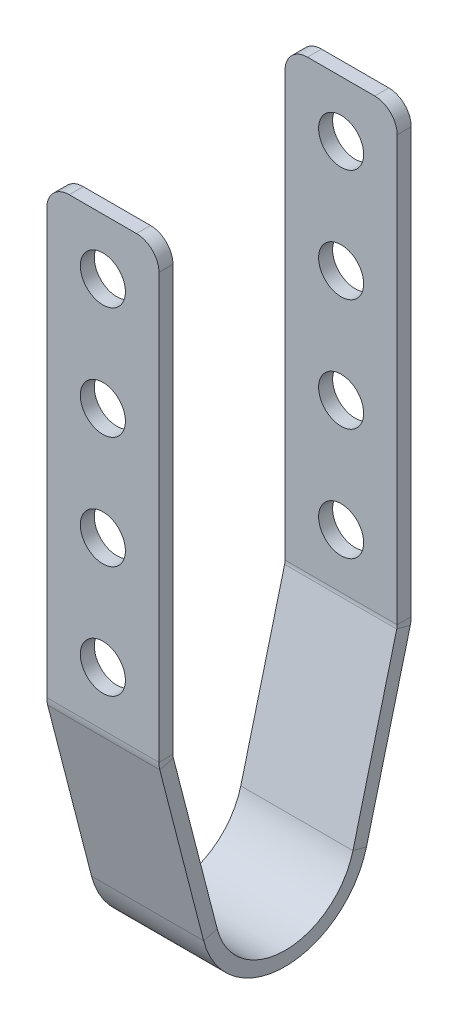
ISO-10303-21;
HEADER;
FILE_DESCRIPTION(('STEP AP214'),'2;1');
FILE_NAME('part.step','',(''),(''),'','','');
FILE_SCHEMA(('AUTOMOTIVE_DESIGN { 1 0 10303 214 1 1 1 1 }'));
ENDSEC;
DATA;
#1=APPLICATION_CONTEXT('core data for automotive mechanical design processes');
#2=APPLICATION_PROTOCOL_DEFINITION('international standard','automotive_design',2000,#1);
#3=PRODUCT_CONTEXT('',#1,'mechanical');
#4=PRODUCT('Part','Part','',(#3));
#5=PRODUCT_RELATED_PRODUCT_CATEGORY('part','',(#4));
#6=PRODUCT_DEFINITION_FORMATION('','',#4);
#7=PRODUCT_DEFINITION_CONTEXT('part definition',#1,'design');
#8=PRODUCT_DEFINITION('design','',#6,#7);
#9=PRODUCT_DEFINITION_SHAPE('','',#8);
#10=(LENGTH_UNIT() NAMED_UNIT(*) SI_UNIT(.MILLI.,.METRE.));
#11=(NAMED_UNIT(*) PLANE_ANGLE_UNIT() SI_UNIT($,.RADIAN.));
#12=(NAMED_UNIT(*) SI_UNIT($,.STERADIAN.) SOLID_ANGLE_UNIT());
#13=UNCERTAINTY_MEASURE_WITH_UNIT(LENGTH_MEASURE(1.E-05),#10,'distance_accuracy_value','');
#14=(GEOMETRIC_REPRESENTATION_CONTEXT(3) GLOBAL_UNCERTAINTY_ASSIGNED_CONTEXT((#13)) GLOBAL_UNIT_ASSIGNED_CONTEXT((#10,
#11,#12)) REPRESENTATION_CONTEXT('',''));
#15=CARTESIAN_POINT('',(0.,0.,0.));
#16=DIRECTION('',(0.,0.,1.));
#17=DIRECTION('',(1.,0.,0.));
#18=AXIS2_PLACEMENT_3D('',#15,#16,#17);
#19=CARTESIAN_POINT('',(6.35,-70.2444244631501,-20.3860836368314));
#20=DIRECTION('',(1.,0.,0.));
#21=DIRECTION('',(0.,0.,-1.));
#22=AXIS2_PLACEMENT_3D('',#19,#20,#21);
#23=PLANE('',#22);
#24=DIRECTION('',(0.,-0.249691270948047,-0.96832549755356));
#25=VECTOR('',#24,1.);
#26=CARTESIAN_POINT('',(6.35,-70.2444244631501,-20.3860836368314));
#27=LINE('',#26,#25);
#28=CARTESIAN_POINT('',(6.35,-70.2444244631501,-20.3860836368314));
#29=VERTEX_POINT('',#28);
#30=CARTESIAN_POINT('',(6.35,-70.6408093557801,-21.9233003641977));
#31=VERTEX_POINT('',#30);
#32=EDGE_CURVE('E352',#29,#31,#27,.T.);
#33=ORIENTED_EDGE('',*,*,#32,.F.);
#34=CARTESIAN_POINT('',(6.35,-68.2625,-12.7));
#35=DIRECTION('',(1.,0.,0.));
#36=DIRECTION('',(0.,0.,-1.));
#37=AXIS2_PLACEMENT_3D('',#34,#35,#36);
#38=CIRCLE('',#37,7.9375);
#39=CARTESIAN_POINT('',(6.35,-70.2444244631501,-5.01391636316861));
#40=VERTEX_POINT('',#39);
#41=EDGE_CURVE('E225',#40,#29,#38,.T.);
#42=ORIENTED_EDGE('',*,*,#41,.F.);
#43=DIRECTION('',(0.,0.249691270948038,-0.968325497553562));
#44=VECTOR('',#43,1.);
#45=CARTESIAN_POINT('',(6.35,-70.6408093557801,-3.47669963580233));
#46=LINE('',#45,#44);
#47=CARTESIAN_POINT('',(6.35,-70.6408093557801,-3.47669963580233));
#48=VERTEX_POINT('',#47);
#49=EDGE_CURVE('E350',#48,#40,#46,.T.);
#50=ORIENTED_EDGE('',*,*,#49,.F.);
#51=CARTESIAN_POINT('',(6.35,-68.2625,-12.7));
#52=DIRECTION('',(1.,0.,0.));
#53=DIRECTION('',(0.,0.,-1.));
#54=AXIS2_PLACEMENT_3D('',#51,#52,#53);
#55=CIRCLE('',#54,9.525);
#56=EDGE_CURVE('E247',#48,#31,#55,.T.);
#57=ORIENTED_EDGE('',*,*,#56,.T.);
#58=EDGE_LOOP('',(#33,#42,#50,#57));
#59=FACE_BOUND('',#58,.T.);
#60=ADVANCED_FACE('F46',(#59),#23,.T.);
#61=CARTESIAN_POINT('',(6.35,-70.6408093557801,-3.47669963580233));
#62=DIRECTION('',(1.,0.,0.));
#63=DIRECTION('',(0.,0.,-1.));
#64=AXIS2_PLACEMENT_3D('',#61,#62,#63);
#65=PLANE('',#64);
#66=DIRECTION('',(0.,0.96832549755356,-0.249691270948044));
#67=VECTOR('',#66,1.);
#68=CARTESIAN_POINT('',(6.35,-70.2444244631501,-20.3860836368314));
#69=LINE('',#68,#67);
#70=CARTESIAN_POINT('',(6.35,-50.9950031124709,-25.3497167273663));
#71=VERTEX_POINT('',#70);
#72=EDGE_CURVE('E223',#29,#71,#69,.T.);
#73=ORIENTED_EDGE('',*,*,#72,.F.);
#74=ORIENTED_EDGE('',*,*,#32,.T.);
#75=DIRECTION('',(0.,0.96832549755356,-0.249691270948044));
#76=VECTOR('',#75,1.);
#77=CARTESIAN_POINT('',(6.35,-70.6408093557801,-21.9233003641977));
#78=LINE('',#77,#76);
#79=CARTESIAN_POINT('',(6.35,-51.391388005101,-26.8869334547325));
#80=VERTEX_POINT('',#79);
#81=EDGE_CURVE('E250',#31,#80,#78,.T.);
#82=ORIENTED_EDGE('',*,*,#81,.T.);
#83=DIRECTION('',(0.,0.249691270948054,0.968325497553558));
#84=VECTOR('',#83,1.);
#85=CARTESIAN_POINT('',(6.35,-51.391388005101,-26.8869334547325));
#86=LINE('',#85,#84);
#87=EDGE_CURVE('E197',#80,#71,#86,.T.);
#88=ORIENTED_EDGE('',*,*,#87,.T.);
#89=EDGE_LOOP('',(#73,#74,#82,#88));
#90=FACE_BOUND('',#89,.T.);
#91=ADVANCED_FACE('F441',(#90),#65,.T.);
#92=CARTESIAN_POINT('',(-6.35,-70.2444244631501,-5.01391636316861));
#93=DIRECTION('',(-1.,0.,0.));
#94=DIRECTION('',(0.,0.,1.));
#95=AXIS2_PLACEMENT_3D('',#92,#93,#94);
#96=PLANE('',#95);
#97=DIRECTION('',(0.,-0.249691270948038,0.968325497553562));
#98=VECTOR('',#97,1.);
#99=CARTESIAN_POINT('',(-6.35,-70.2444244631501,-5.01391636316861));
#100=LINE('',#99,#98);
#101=CARTESIAN_POINT('',(-6.35,-70.2444244631501,-5.01391636316861));
#102=VERTEX_POINT('',#101);
#103=CARTESIAN_POINT('',(-6.35,-70.6408093557801,-3.47669963580233));
#104=VERTEX_POINT('',#103);
#105=EDGE_CURVE('E348',#102,#104,#100,.T.);
#106=ORIENTED_EDGE('',*,*,#105,.F.);
#107=CARTESIAN_POINT('',(-6.35,-68.2625,-12.7));
#108=DIRECTION('',(1.,0.,0.));
#109=DIRECTION('',(0.,0.,-1.));
#110=AXIS2_PLACEMENT_3D('',#107,#108,#109);
#111=CIRCLE('',#110,7.9375);
#112=CARTESIAN_POINT('',(-6.35,-70.2444244631501,-20.3860836368314));
#113=VERTEX_POINT('',#112);
#114=EDGE_CURVE('E265',#102,#113,#111,.T.);
#115=ORIENTED_EDGE('',*,*,#114,.T.);
#116=DIRECTION('',(0.,0.249691270948047,0.96832549755356));
#117=VECTOR('',#116,1.);
#118=CARTESIAN_POINT('',(-6.35,-70.6408093557801,-21.9233003641977));
#119=LINE('',#118,#117);
#120=CARTESIAN_POINT('',(-6.35,-70.6408093557801,-21.9233003641977));
#121=VERTEX_POINT('',#120);
#122=EDGE_CURVE('E346',#121,#113,#119,.T.);
#123=ORIENTED_EDGE('',*,*,#122,.F.);
#124=CARTESIAN_POINT('',(-6.35,-68.2625,-12.7));
#125=DIRECTION('',(1.,0.,0.));
#126=DIRECTION('',(0.,0.,-1.));
#127=AXIS2_PLACEMENT_3D('',#124,#125,#126);
#128=CIRCLE('',#127,9.525);
#129=EDGE_CURVE('E284',#104,#121,#128,.T.);
#130=ORIENTED_EDGE('',*,*,#129,.F.);
#131=EDGE_LOOP('',(#106,#115,#123,#130));
#132=FACE_BOUND('',#131,.T.);
#133=ADVANCED_FACE('F533',(#132),#96,.T.);
#134=CARTESIAN_POINT('',(-6.35,-70.6408093557801,-21.9233003641977));
#135=DIRECTION('',(-1.,0.,0.));
#136=DIRECTION('',(0.,0.,1.));
#137=AXIS2_PLACEMENT_3D('',#134,#135,#136);
#138=PLANE('',#137);
#139=DIRECTION('',(0.,-0.968325497553561,-0.249691270948044));
#140=VECTOR('',#139,1.);
#141=CARTESIAN_POINT('',(-6.35,-50.8,0.));
#142=LINE('',#141,#140);
#143=CARTESIAN_POINT('',(-6.35,-50.9950031124709,-0.0502832726337363));
#144=VERTEX_POINT('',#143);
#145=EDGE_CURVE('E268',#144,#102,#142,.T.);
#146=ORIENTED_EDGE('',*,*,#145,.T.);
#147=ORIENTED_EDGE('',*,*,#105,.T.);
#148=DIRECTION('',(0.,-0.968325497553561,-0.249691270948044));
#149=VECTOR('',#148,1.);
#150=CARTESIAN_POINT('',(-6.35,-51.19638489263,1.53721672736627));
#151=LINE('',#150,#149);
#152=CARTESIAN_POINT('',(-6.35,-51.3913880051009,1.48693345473254));
#153=VERTEX_POINT('',#152);
#154=EDGE_CURVE('E281',#153,#104,#151,.T.);
#155=ORIENTED_EDGE('',*,*,#154,.F.);
#156=DIRECTION('',(0.,0.249691270948043,-0.968325497553561));
#157=VECTOR('',#156,1.);
#158=CARTESIAN_POINT('',(-6.35,-51.3913880051009,1.48693345473254));
#159=LINE('',#158,#157);
#160=EDGE_CURVE('E196',#153,#144,#159,.T.);
#161=ORIENTED_EDGE('',*,*,#160,.T.);
#162=EDGE_LOOP('',(#146,#147,#155,#161));
#163=FACE_BOUND('',#162,.T.);
#164=ADVANCED_FACE('F884',(#163),#138,.T.);
#165=CARTESIAN_POINT('',(6.35,-50.9950031124709,-0.0502832726337363));
#166=DIRECTION('',(1.,0.,0.));
#167=DIRECTION('',(0.,0.,-1.));
#168=AXIS2_PLACEMENT_3D('',#165,#166,#167);
#169=PLANE('',#168);
#170=DIRECTION('',(0.,-0.249691270948043,0.968325497553561));
#171=VECTOR('',#170,1.);
#172=CARTESIAN_POINT('',(6.35,-50.9950031124709,-0.0502832726337363));
#173=LINE('',#172,#171);
#174=CARTESIAN_POINT('',(6.35,-50.9950031124709,-0.0502832726337363));
#175=VERTEX_POINT('',#174);
#176=CARTESIAN_POINT('',(6.35,-51.3913880051009,1.48693345473254));
#177=VERTEX_POINT('',#176);
#178=EDGE_CURVE('E344',#175,#177,#173,.T.);
#179=ORIENTED_EDGE('',*,*,#178,.F.);
#180=CARTESIAN_POINT('',(6.35,-50.5986182198409,-1.58750000000001));
#181=DIRECTION('',(-1.,0.,0.));
#182=DIRECTION('',(0.,0.,1.));
#183=AXIS2_PLACEMENT_3D('',#180,#181,#182);
#184=CIRCLE('',#183,1.5875);
#185=CARTESIAN_POINT('',(6.35,-50.5986182198409,0.));
#186=VERTEX_POINT('',#185);
#187=EDGE_CURVE('E234',#186,#175,#184,.F.);
#188=ORIENTED_EDGE('',*,*,#187,.F.);
#189=DIRECTION('',(0.,0.,-1.));
#190=VECTOR('',#189,1.);
#191=CARTESIAN_POINT('',(6.35,-50.5986182198409,1.58749999999999));
#192=LINE('',#191,#190);
#193=CARTESIAN_POINT('',(6.35,-50.5986182198409,1.58749999999999));
#194=VERTEX_POINT('',#193);
#195=EDGE_CURVE('E341',#194,#186,#192,.T.);
#196=ORIENTED_EDGE('',*,*,#195,.F.);
#197=CARTESIAN_POINT('',(6.35,-50.5986182198409,-1.58750000000001));
#198=DIRECTION('',(1.,0.,0.));
#199=DIRECTION('',(0.,0.,-1.));
#200=AXIS2_PLACEMENT_3D('',#197,#198,#199);
#201=CIRCLE('',#200,3.175);
#202=EDGE_CURVE('E241',#194,#177,#201,.T.);
#203=ORIENTED_EDGE('',*,*,#202,.T.);
#204=EDGE_LOOP('',(#179,#188,#196,#203));
#205=FACE_BOUND('',#204,.T.);
#206=ADVANCED_FACE('F415',(#205),#169,.T.);
#207=CARTESIAN_POINT('',(6.35,-50.5986182198409,1.58749999999999));
#208=DIRECTION('',(1.,0.,0.));
#209=DIRECTION('',(0.,0.,-1.));
#210=AXIS2_PLACEMENT_3D('',#207,#208,#209);
#211=PLANE('',#210);
#212=DIRECTION('',(0.,-0.968325497553561,-0.249691270948044));
#213=VECTOR('',#212,1.);
#214=CARTESIAN_POINT('',(6.35,-50.8,0.));
#215=LINE('',#214,#213);
#216=EDGE_CURVE('E231',#175,#40,#215,.T.);
#217=ORIENTED_EDGE('',*,*,#216,.F.);
#218=ORIENTED_EDGE('',*,*,#178,.T.);
#219=DIRECTION('',(0.,-0.968325497553561,-0.249691270948044));
#220=VECTOR('',#219,1.);
#221=CARTESIAN_POINT('',(6.35,-51.19638489263,1.53721672736627));
#222=LINE('',#221,#220);
#223=EDGE_CURVE('E244',#177,#48,#222,.T.);
#224=ORIENTED_EDGE('',*,*,#223,.T.);
#225=ORIENTED_EDGE('',*,*,#49,.T.);
#226=EDGE_LOOP('',(#217,#218,#224,#225));
#227=FACE_BOUND('',#226,.T.);
#228=ADVANCED_FACE('F424',(#227),#211,.T.);
#229=CARTESIAN_POINT('',(-6.35,-50.5986182198409,0.));
#230=DIRECTION('',(-1.,0.,0.));
#231=DIRECTION('',(0.,0.,1.));
#232=AXIS2_PLACEMENT_3D('',#229,#230,#231);
#233=PLANE('',#232);
#234=DIRECTION('',(0.,0.,1.));
#235=VECTOR('',#234,1.);
#236=CARTESIAN_POINT('',(-6.35,-50.5986182198409,0.));
#237=LINE('',#236,#235);
#238=CARTESIAN_POINT('',(-6.35,-50.5986182198409,0.));
#239=VERTEX_POINT('',#238);
#240=CARTESIAN_POINT('',(-6.35,-50.5986182198409,1.58749999999999));
#241=VERTEX_POINT('',#240);
#242=EDGE_CURVE('E338',#239,#241,#237,.T.);
#243=ORIENTED_EDGE('',*,*,#242,.F.);
#244=CARTESIAN_POINT('',(-6.35,-50.5986182198409,-1.58750000000001));
#245=DIRECTION('',(-1.,0.,0.));
#246=DIRECTION('',(0.,0.,1.));
#247=AXIS2_PLACEMENT_3D('',#244,#245,#246);
#248=CIRCLE('',#247,1.5875);
#249=EDGE_CURVE('E271',#239,#144,#248,.F.);
#250=ORIENTED_EDGE('',*,*,#249,.T.);
#251=ORIENTED_EDGE('',*,*,#160,.F.);
#252=CARTESIAN_POINT('',(-6.35,-50.5986182198409,-1.58750000000001));
#253=DIRECTION('',(1.,0.,0.));
#254=DIRECTION('',(0.,0.,-1.));
#255=AXIS2_PLACEMENT_3D('',#252,#253,#254);
#256=CIRCLE('',#255,3.175);
#257=EDGE_CURVE('E278',#241,#153,#256,.T.);
#258=ORIENTED_EDGE('',*,*,#257,.F.);
#259=EDGE_LOOP('',(#243,#250,#251,#258));
#260=FACE_BOUND('',#259,.T.);
#261=ADVANCED_FACE('F650',(#260),#233,.T.);
#262=CARTESIAN_POINT('',(-6.35,-51.3913880051009,1.48693345473254));
#263=DIRECTION('',(-1.,0.,0.));
#264=DIRECTION('',(0.,0.,1.));
#265=AXIS2_PLACEMENT_3D('',#262,#263,#264);
#266=PLANE('',#265);
#267=DIRECTION('',(0.,-1.,0.));
#268=VECTOR('',#267,1.);
#269=CARTESIAN_POINT('',(-6.35,0.,1.5875));
#270=LINE('',#269,#268);
#271=CARTESIAN_POINT('',(-6.35,-2.54,1.5875));
#272=VERTEX_POINT('',#271);
#273=EDGE_CURVE('E276',#272,#241,#270,.T.);
#274=ORIENTED_EDGE('',*,*,#273,.F.);
#275=DIRECTION('',(0.,0.,-1.));
#276=VECTOR('',#275,1.);
#277=CARTESIAN_POINT('',(-6.35,-2.54,1.48693345473255));
#278=LINE('',#277,#276);
#279=CARTESIAN_POINT('',(-6.35,-2.54,0.));
#280=VERTEX_POINT('',#279);
#281=EDGE_CURVE('E376',#272,#280,#278,.T.);
#282=ORIENTED_EDGE('',*,*,#281,.T.);
#283=DIRECTION('',(0.,-1.,0.));
#284=VECTOR('',#283,1.);
#285=CARTESIAN_POINT('',(-6.35,0.,0.));
#286=LINE('',#285,#284);
#287=EDGE_CURVE('E274',#280,#239,#286,.T.);
#288=ORIENTED_EDGE('',*,*,#287,.T.);
#289=ORIENTED_EDGE('',*,*,#242,.T.);
#290=EDGE_LOOP('',(#274,#282,#288,#289));
#291=FACE_BOUND('',#290,.T.);
#292=ADVANCED_FACE('F396',(#291),#266,.T.);
#293=CARTESIAN_POINT('',(6.35,-50.5986182198409,-25.4));
#294=DIRECTION('',(1.,0.,0.));
#295=DIRECTION('',(0.,0.,-1.));
#296=AXIS2_PLACEMENT_3D('',#293,#294,#295);
#297=PLANE('',#296);
#298=DIRECTION('',(0.,0.,-1.));
#299=VECTOR('',#298,1.);
#300=CARTESIAN_POINT('',(6.35,-50.5986182198409,-25.4));
#301=LINE('',#300,#299);
#302=CARTESIAN_POINT('',(6.35,-50.5986182198409,-25.4));
#303=VERTEX_POINT('',#302);
#304=CARTESIAN_POINT('',(6.35,-50.5986182198409,-26.9875));
#305=VERTEX_POINT('',#304);
#306=EDGE_CURVE('E184',#303,#305,#301,.T.);
#307=ORIENTED_EDGE('',*,*,#306,.F.);
#308=CARTESIAN_POINT('',(6.35,-50.5986182198409,-23.8125));
#309=DIRECTION('',(-1.,0.,0.));
#310=DIRECTION('',(0.,0.,1.));
#311=AXIS2_PLACEMENT_3D('',#308,#309,#310);
#312=CIRCLE('',#311,1.5875);
#313=EDGE_CURVE('E188',#71,#303,#312,.F.);
#314=ORIENTED_EDGE('',*,*,#313,.F.);
#315=ORIENTED_EDGE('',*,*,#87,.F.);
#316=CARTESIAN_POINT('',(6.35,-50.5986182198409,-23.8125));
#317=DIRECTION('',(1.,0.,0.));
#318=DIRECTION('',(0.,0.,-1.));
#319=AXIS2_PLACEMENT_3D('',#316,#317,#318);
#320=CIRCLE('',#319,3.175);
#321=EDGE_CURVE('E191',#80,#305,#320,.T.);
#322=ORIENTED_EDGE('',*,*,#321,.T.);
#323=EDGE_LOOP('',(#307,#314,#315,#322));
#324=FACE_BOUND('',#323,.T.);
#325=ADVANCED_FACE('F186',(#324),#297,.T.);
#326=CARTESIAN_POINT('',(6.35,-51.391388005101,-26.8869334547325));
#327=DIRECTION('',(1.,0.,0.));
#328=DIRECTION('',(0.,0.,-1.));
#329=AXIS2_PLACEMENT_3D('',#326,#327,#328);
#330=PLANE('',#329);
#331=DIRECTION('',(0.,1.,0.));
#332=VECTOR('',#331,1.);
#333=CARTESIAN_POINT('',(6.35,-50.8,-26.9875));
#334=LINE('',#333,#332);
#335=CARTESIAN_POINT('',(6.35,-2.54,-26.9875));
#336=VERTEX_POINT('',#335);
#337=EDGE_CURVE('E218',#305,#336,#334,.T.);
#338=ORIENTED_EDGE('',*,*,#337,.T.);
#339=DIRECTION('',(0.,0.,-1.));
#340=VECTOR('',#339,1.);
#341=CARTESIAN_POINT('',(6.35,-2.54,-26.8869334547325));
#342=LINE('',#341,#340);
#343=CARTESIAN_POINT('',(6.35,-2.54,-25.4));
#344=VERTEX_POINT('',#343);
#345=EDGE_CURVE('E217',#336,#344,#342,.F.);
#346=ORIENTED_EDGE('',*,*,#345,.T.);
#347=DIRECTION('',(0.,1.,0.));
#348=VECTOR('',#347,1.);
#349=CARTESIAN_POINT('',(6.35,-50.8,-25.4));
#350=LINE('',#349,#348);
#351=EDGE_CURVE('E205',#303,#344,#350,.T.);
#352=ORIENTED_EDGE('',*,*,#351,.F.);
#353=ORIENTED_EDGE('',*,*,#306,.T.);
#354=EDGE_LOOP('',(#338,#346,#352,#353));
#355=FACE_BOUND('',#354,.T.);
#356=ADVANCED_FACE('F215',(#355),#330,.T.);
#357=CARTESIAN_POINT('',(-6.35,-50.9950031124709,-25.3497167273663));
#358=DIRECTION('',(-1.,0.,0.));
#359=DIRECTION('',(0.,0.,1.));
#360=AXIS2_PLACEMENT_3D('',#357,#358,#359);
#361=PLANE('',#360);
#362=DIRECTION('',(0.,-0.249691270948054,-0.968325497553558));
#363=VECTOR('',#362,1.);
#364=CARTESIAN_POINT('',(-6.35,-50.9950031124709,-25.3497167273663));
#365=LINE('',#364,#363);
#366=CARTESIAN_POINT('',(-6.35,-50.9950031124709,-25.3497167273663));
#367=VERTEX_POINT('',#366);
#368=CARTESIAN_POINT('',(-6.35,-51.391388005101,-26.8869334547325));
#369=VERTEX_POINT('',#368);
#370=EDGE_CURVE('E334',#367,#369,#365,.T.);
#371=ORIENTED_EDGE('',*,*,#370,.F.);
#372=CARTESIAN_POINT('',(-6.35,-50.5986182198409,-23.8125));
#373=DIRECTION('',(-1.,0.,0.));
#374=DIRECTION('',(0.,0.,1.));
#375=AXIS2_PLACEMENT_3D('',#372,#373,#374);
#376=CIRCLE('',#375,1.5875);
#377=CARTESIAN_POINT('',(-6.35,-50.5986182198409,-25.4));
#378=VERTEX_POINT('',#377);
#379=EDGE_CURVE('E260',#367,#378,#376,.F.);
#380=ORIENTED_EDGE('',*,*,#379,.T.);
#381=DIRECTION('',(0.,0.,1.));
#382=VECTOR('',#381,1.);
#383=CARTESIAN_POINT('',(-6.35,-50.5986182198409,-26.9875));
#384=LINE('',#383,#382);
#385=CARTESIAN_POINT('',(-6.35,-50.5986182198409,-26.9875));
#386=VERTEX_POINT('',#385);
#387=EDGE_CURVE('E332',#386,#378,#384,.T.);
#388=ORIENTED_EDGE('',*,*,#387,.F.);
#389=CARTESIAN_POINT('',(-6.35,-50.5986182198409,-23.8125));
#390=DIRECTION('',(1.,0.,0.));
#391=DIRECTION('',(0.,0.,-1.));
#392=AXIS2_PLACEMENT_3D('',#389,#390,#391);
#393=CIRCLE('',#392,3.175);
#394=EDGE_CURVE('E290',#369,#386,#393,.T.);
#395=ORIENTED_EDGE('',*,*,#394,.F.);
#396=EDGE_LOOP('',(#371,#380,#388,#395));
#397=FACE_BOUND('',#396,.T.);
#398=ADVANCED_FACE('F640',(#397),#361,.T.);
#399=CARTESIAN_POINT('',(-6.35,-50.5986182198409,-26.9875));
#400=DIRECTION('',(-1.,0.,0.));
#401=DIRECTION('',(0.,0.,1.));
#402=AXIS2_PLACEMENT_3D('',#399,#400,#401);
#403=PLANE('',#402);
#404=DIRECTION('',(0.,0.96832549755356,-0.249691270948044));
#405=VECTOR('',#404,1.);
#406=CARTESIAN_POINT('',(-6.35,-70.2444244631501,-20.3860836368314));
#407=LINE('',#406,#405);
#408=EDGE_CURVE('E262',#113,#367,#407,.T.);
#409=ORIENTED_EDGE('',*,*,#408,.T.);
#410=ORIENTED_EDGE('',*,*,#370,.T.);
#411=DIRECTION('',(0.,0.96832549755356,-0.249691270948044));
#412=VECTOR('',#411,1.);
#413=CARTESIAN_POINT('',(-6.35,-70.6408093557801,-21.9233003641977));
#414=LINE('',#413,#412);
#415=EDGE_CURVE('E287',#121,#369,#414,.T.);
#416=ORIENTED_EDGE('',*,*,#415,.F.);
#417=ORIENTED_EDGE('',*,*,#122,.T.);
#418=EDGE_LOOP('',(#409,#410,#416,#417));
#419=FACE_BOUND('',#418,.T.);
#420=ADVANCED_FACE('F630',(#419),#403,.T.);
#421=CARTESIAN_POINT('',(6.35,-50.8,-26.9875));
#422=DIRECTION('',(0.,0.,1.));
#423=DIRECTION('',(1.,0.,0.));
#424=AXIS2_PLACEMENT_3D('',#421,#422,#423);
#425=PLANE('',#424);
#426=CARTESIAN_POINT('',(0.,-6.35,-26.9875));
#427=DIRECTION('',(0.,0.,1.));
#428=DIRECTION('',(1.,0.,0.));
#429=AXIS2_PLACEMENT_3D('',#426,#427,#428);
#430=CIRCLE('',#429,2.5527);
#431=CARTESIAN_POINT('',(2.5527,-6.35,-26.9875));
#432=VERTEX_POINT('',#431);
#433=EDGE_CURVE('E359',#432,#432,#430,.T.);
#434=ORIENTED_EDGE('',*,*,#433,.T.);
#435=EDGE_LOOP('',(#434));
#436=FACE_BOUND('',#435,.T.);
#437=CARTESIAN_POINT('',(1.32247788292465E-13,-19.05,-26.9875));
#438=DIRECTION('',(0.,0.,1.));
#439=DIRECTION('',(1.,0.,0.));
#440=AXIS2_PLACEMENT_3D('',#437,#438,#439);
#441=CIRCLE('',#440,2.5527);
#442=CARTESIAN_POINT('',(2.55270000000013,-19.05,-26.9875));
#443=VERTEX_POINT('',#442);
#444=EDGE_CURVE('E485',#443,#443,#441,.T.);
#445=ORIENTED_EDGE('',*,*,#444,.T.);
#446=EDGE_LOOP('',(#445));
#447=FACE_BOUND('',#446,.T.);
#448=CARTESIAN_POINT('',(2.6449557658493E-13,-31.75,-26.9875));
#449=DIRECTION('',(0.,0.,1.));
#450=DIRECTION('',(1.,0.,0.));
#451=AXIS2_PLACEMENT_3D('',#448,#449,#450);
#452=CIRCLE('',#451,2.5527);
#453=CARTESIAN_POINT('',(2.55270000000026,-31.75,-26.9875));
#454=VERTEX_POINT('',#453);
#455=EDGE_CURVE('E473',#454,#454,#452,.T.);
#456=ORIENTED_EDGE('',*,*,#455,.T.);
#457=EDGE_LOOP('',(#456));
#458=FACE_BOUND('',#457,.T.);
#459=CARTESIAN_POINT('',(3.96743364877394E-13,-44.45,-26.9875));
#460=DIRECTION('',(0.,0.,1.));
#461=DIRECTION('',(1.,0.,0.));
#462=AXIS2_PLACEMENT_3D('',#459,#460,#461);
#463=CIRCLE('',#462,2.5527);
#464=CARTESIAN_POINT('',(2.55270000000039,-44.45,-26.9875));
#465=VERTEX_POINT('',#464);
#466=EDGE_CURVE('E461',#465,#465,#463,.T.);
#467=ORIENTED_EDGE('',*,*,#466,.T.);
#468=EDGE_LOOP('',(#467));
#469=FACE_BOUND('',#468,.T.);
#470=DIRECTION('',(-1.,0.,0.));
#471=VECTOR('',#470,1.);
#472=CARTESIAN_POINT('',(6.35,0.,-26.9875));
#473=LINE('',#472,#471);
#474=CARTESIAN_POINT('',(3.81,0.,-26.9875));
#475=VERTEX_POINT('',#474);
#476=CARTESIAN_POINT('',(-3.81,0.,-26.9875));
#477=VERTEX_POINT('',#476);
#478=EDGE_CURVE('E329',#475,#477,#473,.T.);
#479=ORIENTED_EDGE('',*,*,#478,.F.);
#480=CARTESIAN_POINT('',(3.81,-2.54,-26.9875));
#481=DIRECTION('',(0.,0.,1.));
#482=DIRECTION('',(1.,0.,0.));
#483=AXIS2_PLACEMENT_3D('',#480,#481,#482);
#484=CIRCLE('',#483,2.54);
#485=EDGE_CURVE('E366',#475,#336,#484,.F.);
#486=ORIENTED_EDGE('',*,*,#485,.T.);
#487=ORIENTED_EDGE('',*,*,#337,.F.);
#488=DIRECTION('',(-1.,0.,0.));
#489=VECTOR('',#488,1.);
#490=CARTESIAN_POINT('',(6.35,-50.5986182198409,-26.9875));
#491=LINE('',#490,#489);
#492=EDGE_CURVE('E254',#305,#386,#491,.T.);
#493=ORIENTED_EDGE('',*,*,#492,.T.);
#494=DIRECTION('',(0.,1.,0.));
#495=VECTOR('',#494,1.);
#496=CARTESIAN_POINT('',(-6.35,-50.8,-26.9875));
#497=LINE('',#496,#495);
#498=CARTESIAN_POINT('',(-6.35,-2.54,-26.9875));
#499=VERTEX_POINT('',#498);
#500=EDGE_CURVE('E255',#386,#499,#497,.T.);
#501=ORIENTED_EDGE('',*,*,#500,.T.);
#502=CARTESIAN_POINT('',(-3.81,-2.54,-26.9875));
#503=DIRECTION('',(0.,0.,1.));
#504=DIRECTION('',(1.,0.,0.));
#505=AXIS2_PLACEMENT_3D('',#502,#503,#504);
#506=CIRCLE('',#505,2.54);
#507=EDGE_CURVE('E364',#499,#477,#506,.F.);
#508=ORIENTED_EDGE('',*,*,#507,.T.);
#509=EDGE_LOOP('',(#479,#486,#487,#493,#501,#508));
#510=FACE_BOUND('',#509,.T.);
#511=ADVANCED_FACE('F454',(#436,#447,#458,#469,#510),#425,.F.);
#512=CARTESIAN_POINT('',(6.35,0.,-25.4));
#513=DIRECTION('',(0.,1.,0.));
#514=DIRECTION('',(0.,0.,1.));
#515=AXIS2_PLACEMENT_3D('',#512,#513,#514);
#516=PLANE('',#515);
#517=DIRECTION('',(-1.,0.,0.));
#518=VECTOR('',#517,1.);
#519=CARTESIAN_POINT('',(6.35,0.,-25.4));
#520=LINE('',#519,#518);
#521=CARTESIAN_POINT('',(3.81,0.,-25.4));
#522=VERTEX_POINT('',#521);
#523=CARTESIAN_POINT('',(-3.81,0.,-25.4));
#524=VERTEX_POINT('',#523);
#525=EDGE_CURVE('E212',#522,#524,#520,.T.);
#526=ORIENTED_EDGE('',*,*,#525,.F.);
#527=DIRECTION('',(0.,0.,-1.));
#528=VECTOR('',#527,1.);
#529=CARTESIAN_POINT('',(3.81,0.,-25.4));
#530=LINE('',#529,#528);
#531=EDGE_CURVE('E361',#522,#475,#530,.T.);
#532=ORIENTED_EDGE('',*,*,#531,.T.);
#533=ORIENTED_EDGE('',*,*,#478,.T.);
#534=DIRECTION('',(0.,0.,-1.));
#535=VECTOR('',#534,1.);
#536=CARTESIAN_POINT('',(-3.81,0.,-25.4));
#537=LINE('',#536,#535);
#538=EDGE_CURVE('E354',#477,#524,#537,.F.);
#539=ORIENTED_EDGE('',*,*,#538,.T.);
#540=EDGE_LOOP('',(#526,#532,#533,#539));
#541=FACE_BOUND('',#540,.T.);
#542=ADVANCED_FACE('F612',(#541),#516,.T.);
#543=CARTESIAN_POINT('',(6.35,-50.8,-25.4));
#544=DIRECTION('',(0.,0.,1.));
#545=DIRECTION('',(1.,0.,0.));
#546=AXIS2_PLACEMENT_3D('',#543,#544,#545);
#547=PLANE('',#546);
#548=CARTESIAN_POINT('',(0.,-6.35,-25.4));
#549=DIRECTION('',(0.,0.,1.));
#550=DIRECTION('',(1.,0.,0.));
#551=AXIS2_PLACEMENT_3D('',#548,#549,#550);
#552=CIRCLE('',#551,2.55269999999999);
#553=CARTESIAN_POINT('',(2.55269999999999,-6.35,-25.4));
#554=VERTEX_POINT('',#553);
#555=EDGE_CURVE('E355',#554,#554,#552,.T.);
#556=ORIENTED_EDGE('',*,*,#555,.F.);
#557=EDGE_LOOP('',(#556));
#558=FACE_BOUND('',#557,.T.);
#559=CARTESIAN_POINT('',(1.32247788292465E-13,-19.05,-25.4));
#560=DIRECTION('',(0.,0.,1.));
#561=DIRECTION('',(1.,0.,0.));
#562=AXIS2_PLACEMENT_3D('',#559,#560,#561);
#563=CIRCLE('',#562,2.55269999999999);
#564=CARTESIAN_POINT('',(2.55270000000012,-19.05,-25.4));
#565=VERTEX_POINT('',#564);
#566=EDGE_CURVE('E482',#565,#565,#563,.T.);
#567=ORIENTED_EDGE('',*,*,#566,.F.);
#568=EDGE_LOOP('',(#567));
#569=FACE_BOUND('',#568,.T.);
#570=CARTESIAN_POINT('',(2.6449557658493E-13,-31.75,-25.4));
#571=DIRECTION('',(0.,0.,1.));
#572=DIRECTION('',(1.,0.,0.));
#573=AXIS2_PLACEMENT_3D('',#570,#571,#572);
#574=CIRCLE('',#573,2.55269999999999);
#575=CARTESIAN_POINT('',(2.55270000000026,-31.75,-25.4));
#576=VERTEX_POINT('',#575);
#577=EDGE_CURVE('E470',#576,#576,#574,.T.);
#578=ORIENTED_EDGE('',*,*,#577,.F.);
#579=EDGE_LOOP('',(#578));
#580=FACE_BOUND('',#579,.T.);
#581=CARTESIAN_POINT('',(3.96743364877394E-13,-44.45,-25.4));
#582=DIRECTION('',(0.,0.,1.));
#583=DIRECTION('',(1.,0.,0.));
#584=AXIS2_PLACEMENT_3D('',#581,#582,#583);
#585=CIRCLE('',#584,2.55269999999999);
#586=CARTESIAN_POINT('',(2.55270000000039,-44.45,-25.4));
#587=VERTEX_POINT('',#586);
#588=EDGE_CURVE('E258',#587,#587,#585,.T.);
#589=ORIENTED_EDGE('',*,*,#588,.F.);
#590=EDGE_LOOP('',(#589));
#591=FACE_BOUND('',#590,.T.);
#592=ORIENTED_EDGE('',*,*,#351,.T.);
#593=CARTESIAN_POINT('',(3.81,-2.54,-25.4));
#594=DIRECTION('',(0.,0.,1.));
#595=DIRECTION('',(1.,0.,0.));
#596=AXIS2_PLACEMENT_3D('',#593,#594,#595);
#597=CIRCLE('',#596,2.54);
#598=EDGE_CURVE('E371',#344,#522,#597,.T.);
#599=ORIENTED_EDGE('',*,*,#598,.T.);
#600=ORIENTED_EDGE('',*,*,#525,.T.);
#601=CARTESIAN_POINT('',(-3.81,-2.54,-25.4));
#602=DIRECTION('',(0.,0.,1.));
#603=DIRECTION('',(1.,0.,0.));
#604=AXIS2_PLACEMENT_3D('',#601,#602,#603);
#605=CIRCLE('',#604,2.54);
#606=CARTESIAN_POINT('',(-6.35,-2.54,-25.4));
#607=VERTEX_POINT('',#606);
#608=EDGE_CURVE('E369',#524,#607,#605,.T.);
#609=ORIENTED_EDGE('',*,*,#608,.T.);
#610=DIRECTION('',(0.,1.,0.));
#611=VECTOR('',#610,1.);
#612=CARTESIAN_POINT('',(-6.35,-50.8,-25.4));
#613=LINE('',#612,#611);
#614=EDGE_CURVE('E208',#378,#607,#613,.T.);
#615=ORIENTED_EDGE('',*,*,#614,.F.);
#616=DIRECTION('',(-1.,0.,0.));
#617=VECTOR('',#616,1.);
#618=CARTESIAN_POINT('',(6.35,-50.5986182198409,-25.4));
#619=LINE('',#618,#617);
#620=EDGE_CURVE('E203',#303,#378,#619,.T.);
#621=ORIENTED_EDGE('',*,*,#620,.F.);
#622=EDGE_LOOP('',(#592,#599,#600,#609,#615,#621));
#623=FACE_BOUND('',#622,.T.);
#624=ADVANCED_FACE('F204',(#558,#569,#580,#591,#623),#547,.T.);
#625=CARTESIAN_POINT('',(6.35,-50.5986182198409,-23.8125));
#626=DIRECTION('',(-1.,0.,0.));
#627=DIRECTION('',(0.,0.,1.));
#628=AXIS2_PLACEMENT_3D('',#625,#626,#627);
#629=CYLINDRICAL_SURFACE('',#628,1.5875);
#630=ORIENTED_EDGE('',*,*,#379,.F.);
#631=DIRECTION('',(-1.,0.,0.));
#632=VECTOR('',#631,1.);
#633=CARTESIAN_POINT('',(6.35,-50.9950031124709,-25.3497167273663));
#634=LINE('',#633,#632);
#635=EDGE_CURVE('E213',#71,#367,#634,.T.);
#636=ORIENTED_EDGE('',*,*,#635,.F.);
#637=ORIENTED_EDGE('',*,*,#313,.T.);
#638=ORIENTED_EDGE('',*,*,#620,.T.);
#639=EDGE_LOOP('',(#630,#636,#637,#638));
#640=FACE_BOUND('',#639,.T.);
#641=ADVANCED_FACE('F221',(#640),#629,.F.);
#642=CARTESIAN_POINT('',(6.35,-70.2444244631501,-20.3860836368314));
#643=DIRECTION('',(0.,0.249691270948044,0.96832549755356));
#644=DIRECTION('',(0.,-0.96832549755356,0.249691270948044));
#645=AXIS2_PLACEMENT_3D('',#642,#643,#644);
#646=PLANE('',#645);
#647=ORIENTED_EDGE('',*,*,#408,.F.);
#648=DIRECTION('',(-1.,0.,0.));
#649=VECTOR('',#648,1.);
#650=CARTESIAN_POINT('',(6.35,-70.2444244631501,-20.3860836368314));
#651=LINE('',#650,#649);
#652=EDGE_CURVE('E323',#29,#113,#651,.T.);
#653=ORIENTED_EDGE('',*,*,#652,.F.);
#654=ORIENTED_EDGE('',*,*,#72,.T.);
#655=ORIENTED_EDGE('',*,*,#635,.T.);
#656=EDGE_LOOP('',(#647,#653,#654,#655));
#657=FACE_BOUND('',#656,.T.);
#658=ADVANCED_FACE('F440',(#657),#646,.T.);
#659=CARTESIAN_POINT('',(6.35,-68.2625,-12.7));
#660=DIRECTION('',(-1.,0.,0.));
#661=DIRECTION('',(0.,0.,1.));
#662=AXIS2_PLACEMENT_3D('',#659,#660,#661);
#663=CYLINDRICAL_SURFACE('',#662,7.9375);
#664=ORIENTED_EDGE('',*,*,#114,.F.);
#665=DIRECTION('',(-1.,0.,0.));
#666=VECTOR('',#665,1.);
#667=CARTESIAN_POINT('',(6.35,-70.2444244631501,-5.01391636316861));
#668=LINE('',#667,#666);
#669=EDGE_CURVE('E320',#40,#102,#668,.T.);
#670=ORIENTED_EDGE('',*,*,#669,.F.);
#671=ORIENTED_EDGE('',*,*,#41,.T.);
#672=ORIENTED_EDGE('',*,*,#652,.T.);
#673=EDGE_LOOP('',(#664,#670,#671,#672));
#674=FACE_BOUND('',#673,.T.);
#675=ADVANCED_FACE('F432',(#674),#663,.F.);
#676=CARTESIAN_POINT('',(6.35,-50.8,0.));
#677=DIRECTION('',(0.,0.249691270948044,-0.968325497553561));
#678=DIRECTION('',(0.,0.968325497553561,0.249691270948044));
#679=AXIS2_PLACEMENT_3D('',#676,#677,#678);
#680=PLANE('',#679);
#681=ORIENTED_EDGE('',*,*,#145,.F.);
#682=DIRECTION('',(-1.,0.,0.));
#683=VECTOR('',#682,1.);
#684=CARTESIAN_POINT('',(6.35,-50.9950031124709,-0.0502832726337363));
#685=LINE('',#684,#683);
#686=EDGE_CURVE('E317',#175,#144,#685,.T.);
#687=ORIENTED_EDGE('',*,*,#686,.F.);
#688=ORIENTED_EDGE('',*,*,#216,.T.);
#689=ORIENTED_EDGE('',*,*,#669,.T.);
#690=EDGE_LOOP('',(#681,#687,#688,#689));
#691=FACE_BOUND('',#690,.T.);
#692=ADVANCED_FACE('F423',(#691),#680,.T.);
#693=CARTESIAN_POINT('',(6.35,-50.5986182198409,-1.58750000000001));
#694=DIRECTION('',(-1.,0.,0.));
#695=DIRECTION('',(0.,0.,1.));
#696=AXIS2_PLACEMENT_3D('',#693,#694,#695);
#697=CYLINDRICAL_SURFACE('',#696,1.5875);
#698=ORIENTED_EDGE('',*,*,#249,.F.);
#699=DIRECTION('',(-1.,0.,0.));
#700=VECTOR('',#699,1.);
#701=CARTESIAN_POINT('',(6.35,-50.5986182198409,0.));
#702=LINE('',#701,#700);
#703=EDGE_CURVE('E314',#186,#239,#702,.T.);
#704=ORIENTED_EDGE('',*,*,#703,.F.);
#705=ORIENTED_EDGE('',*,*,#187,.T.);
#706=ORIENTED_EDGE('',*,*,#686,.T.);
#707=EDGE_LOOP('',(#698,#704,#705,#706));
#708=FACE_BOUND('',#707,.T.);
#709=ADVANCED_FACE('F414',(#708),#697,.F.);
#710=CARTESIAN_POINT('',(6.35,0.,0.));
#711=DIRECTION('',(0.,0.,-1.));
#712=DIRECTION('',(0.,1.,0.));
#713=AXIS2_PLACEMENT_3D('',#710,#711,#712);
#714=PLANE('',#713);
#715=CARTESIAN_POINT('',(0.,-6.35,0.));
#716=DIRECTION('',(0.,0.,-1.));
#717=DIRECTION('',(0.,1.,0.));
#718=AXIS2_PLACEMENT_3D('',#715,#716,#717);
#719=CIRCLE('',#718,2.55269999999999);
#720=CARTESIAN_POINT('',(0.,-3.79730000000001,0.));
#721=VERTEX_POINT('',#720);
#722=EDGE_CURVE('E358',#721,#721,#719,.T.);
#723=ORIENTED_EDGE('',*,*,#722,.F.);
#724=EDGE_LOOP('',(#723));
#725=FACE_BOUND('',#724,.T.);
#726=CARTESIAN_POINT('',(1.32247788292465E-13,-19.05,0.));
#727=DIRECTION('',(0.,0.,-1.));
#728=DIRECTION('',(0.,1.,0.));
#729=AXIS2_PLACEMENT_3D('',#726,#727,#728);
#730=CIRCLE('',#729,2.55269999999999);
#731=CARTESIAN_POINT('',(1.32247788292465E-13,-16.4973,0.));
#732=VERTEX_POINT('',#731);
#733=EDGE_CURVE('E479',#732,#732,#730,.T.);
#734=ORIENTED_EDGE('',*,*,#733,.F.);
#735=EDGE_LOOP('',(#734));
#736=FACE_BOUND('',#735,.T.);
#737=CARTESIAN_POINT('',(2.6449557658493E-13,-31.75,0.));
#738=DIRECTION('',(0.,0.,-1.));
#739=DIRECTION('',(0.,1.,0.));
#740=AXIS2_PLACEMENT_3D('',#737,#738,#739);
#741=CIRCLE('',#740,2.55269999999999);
#742=CARTESIAN_POINT('',(2.6449557658493E-13,-29.1973,0.));
#743=VERTEX_POINT('',#742);
#744=EDGE_CURVE('E467',#743,#743,#741,.T.);
#745=ORIENTED_EDGE('',*,*,#744,.F.);
#746=EDGE_LOOP('',(#745));
#747=FACE_BOUND('',#746,.T.);
#748=CARTESIAN_POINT('',(3.96743364877394E-13,-44.45,0.));
#749=DIRECTION('',(0.,0.,-1.));
#750=DIRECTION('',(0.,1.,0.));
#751=AXIS2_PLACEMENT_3D('',#748,#749,#750);
#752=CIRCLE('',#751,2.55269999999999);
#753=CARTESIAN_POINT('',(3.96743364877394E-13,-41.8973,0.));
#754=VERTEX_POINT('',#753);
#755=EDGE_CURVE('E458',#754,#754,#752,.T.);
#756=ORIENTED_EDGE('',*,*,#755,.F.);
#757=EDGE_LOOP('',(#756));
#758=FACE_BOUND('',#757,.T.);
#759=ORIENTED_EDGE('',*,*,#287,.F.);
#760=CARTESIAN_POINT('',(-3.81,-2.54,0.));
#761=DIRECTION('',(0.,0.,-1.));
#762=DIRECTION('',(0.,1.,0.));
#763=AXIS2_PLACEMENT_3D('',#760,#761,#762);
#764=CIRCLE('',#763,2.54);
#765=CARTESIAN_POINT('',(-3.81,0.,0.));
#766=VERTEX_POINT('',#765);
#767=EDGE_CURVE('E381',#280,#766,#764,.T.);
#768=ORIENTED_EDGE('',*,*,#767,.T.);
#769=DIRECTION('',(-1.,0.,0.));
#770=VECTOR('',#769,1.);
#771=CARTESIAN_POINT('',(6.35,0.,0.));
#772=LINE('',#771,#770);
#773=CARTESIAN_POINT('',(3.81,0.,0.));
#774=VERTEX_POINT('',#773);
#775=EDGE_CURVE('E312',#774,#766,#772,.T.);
#776=ORIENTED_EDGE('',*,*,#775,.F.);
#777=CARTESIAN_POINT('',(3.81,-2.54,0.));
#778=DIRECTION('',(0.,0.,-1.));
#779=DIRECTION('',(0.,1.,0.));
#780=AXIS2_PLACEMENT_3D('',#777,#778,#779);
#781=CIRCLE('',#780,2.54);
#782=CARTESIAN_POINT('',(6.35,-2.54,0.));
#783=VERTEX_POINT('',#782);
#784=EDGE_CURVE('E379',#774,#783,#781,.T.);
#785=ORIENTED_EDGE('',*,*,#784,.T.);
#786=DIRECTION('',(0.,-1.,0.));
#787=VECTOR('',#786,1.);
#788=CARTESIAN_POINT('',(6.35,0.,0.));
#789=LINE('',#788,#787);
#790=EDGE_CURVE('E237',#783,#186,#789,.T.);
#791=ORIENTED_EDGE('',*,*,#790,.T.);
#792=ORIENTED_EDGE('',*,*,#703,.T.);
#793=EDGE_LOOP('',(#759,#768,#776,#785,#791,#792));
#794=FACE_BOUND('',#793,.T.);
#795=ADVANCED_FACE('F402',(#725,#736,#747,#758,#794),#714,.T.);
#796=CARTESIAN_POINT('',(6.35,0.,1.5875));
#797=DIRECTION('',(0.,1.,0.));
#798=DIRECTION('',(0.,0.,1.));
#799=AXIS2_PLACEMENT_3D('',#796,#797,#798);
#800=PLANE('',#799);
#801=ORIENTED_EDGE('',*,*,#775,.T.);
#802=DIRECTION('',(0.,0.,-1.));
#803=VECTOR('',#802,1.);
#804=CARTESIAN_POINT('',(-3.81,0.,1.5875));
#805=LINE('',#804,#803);
#806=CARTESIAN_POINT('',(-3.81,0.,1.5875));
#807=VERTEX_POINT('',#806);
#808=EDGE_CURVE('E67',#766,#807,#805,.F.);
#809=ORIENTED_EDGE('',*,*,#808,.T.);
#810=DIRECTION('',(-1.,0.,0.));
#811=VECTOR('',#810,1.);
#812=CARTESIAN_POINT('',(6.35,0.,1.5875));
#813=LINE('',#812,#811);
#814=CARTESIAN_POINT('',(3.81,0.,1.5875));
#815=VERTEX_POINT('',#814);
#816=EDGE_CURVE('E310',#815,#807,#813,.T.);
#817=ORIENTED_EDGE('',*,*,#816,.F.);
#818=DIRECTION('',(0.,0.,-1.));
#819=VECTOR('',#818,1.);
#820=CARTESIAN_POINT('',(3.81,0.,0.));
#821=LINE('',#820,#819);
#822=EDGE_CURVE('E383',#815,#774,#821,.T.);
#823=ORIENTED_EDGE('',*,*,#822,.T.);
#824=EDGE_LOOP('',(#801,#809,#817,#823));
#825=FACE_BOUND('',#824,.T.);
#826=ADVANCED_FACE('F403',(#825),#800,.T.);
#827=CARTESIAN_POINT('',(6.35,0.,1.5875));
#828=DIRECTION('',(0.,0.,-1.));
#829=DIRECTION('',(0.,1.,0.));
#830=AXIS2_PLACEMENT_3D('',#827,#828,#829);
#831=PLANE('',#830);
#832=CARTESIAN_POINT('',(0.,-6.35,1.5875));
#833=DIRECTION('',(0.,0.,1.));
#834=DIRECTION('',(1.,0.,0.));
#835=AXIS2_PLACEMENT_3D('',#832,#833,#834);
#836=CIRCLE('',#835,2.55269999999999);
#837=CARTESIAN_POINT('',(2.55269999999999,-6.35,1.5875));
#838=VERTEX_POINT('',#837);
#839=EDGE_CURVE('E495',#838,#838,#836,.T.);
#840=ORIENTED_EDGE('',*,*,#839,.F.);
#841=EDGE_LOOP('',(#840));
#842=FACE_BOUND('',#841,.T.);
#843=CARTESIAN_POINT('',(1.32247788292465E-13,-19.05,1.5875));
#844=DIRECTION('',(0.,0.,1.));
#845=DIRECTION('',(1.,0.,0.));
#846=AXIS2_PLACEMENT_3D('',#843,#844,#845);
#847=CIRCLE('',#846,2.55269999999999);
#848=CARTESIAN_POINT('',(2.55270000000012,-19.05,1.5875));
#849=VERTEX_POINT('',#848);
#850=EDGE_CURVE('E488',#849,#849,#847,.T.);
#851=ORIENTED_EDGE('',*,*,#850,.F.);
#852=EDGE_LOOP('',(#851));
#853=FACE_BOUND('',#852,.T.);
#854=CARTESIAN_POINT('',(2.6449557658493E-13,-31.75,1.5875));
#855=DIRECTION('',(0.,0.,1.));
#856=DIRECTION('',(1.,0.,0.));
#857=AXIS2_PLACEMENT_3D('',#854,#855,#856);
#858=CIRCLE('',#857,2.55269999999999);
#859=CARTESIAN_POINT('',(2.55270000000025,-31.75,1.5875));
#860=VERTEX_POINT('',#859);
#861=EDGE_CURVE('E476',#860,#860,#858,.T.);
#862=ORIENTED_EDGE('',*,*,#861,.F.);
#863=EDGE_LOOP('',(#862));
#864=FACE_BOUND('',#863,.T.);
#865=CARTESIAN_POINT('',(3.96743364877394E-13,-44.45,1.5875));
#866=DIRECTION('',(0.,0.,1.));
#867=DIRECTION('',(1.,0.,0.));
#868=AXIS2_PLACEMENT_3D('',#865,#866,#867);
#869=CIRCLE('',#868,2.55269999999999);
#870=CARTESIAN_POINT('',(2.55270000000038,-44.45,1.5875));
#871=VERTEX_POINT('',#870);
#872=EDGE_CURVE('E464',#871,#871,#869,.T.);
#873=ORIENTED_EDGE('',*,*,#872,.F.);
#874=EDGE_LOOP('',(#873));
#875=FACE_BOUND('',#874,.T.);
#876=ORIENTED_EDGE('',*,*,#816,.T.);
#877=CARTESIAN_POINT('',(-3.81,-2.54,1.5875));
#878=DIRECTION('',(0.,0.,-1.));
#879=DIRECTION('',(0.,1.,0.));
#880=AXIS2_PLACEMENT_3D('',#877,#878,#879);
#881=CIRCLE('',#880,2.54);
#882=EDGE_CURVE('E54',#807,#272,#881,.F.);
#883=ORIENTED_EDGE('',*,*,#882,.T.);
#884=ORIENTED_EDGE('',*,*,#273,.T.);
#885=DIRECTION('',(-1.,0.,0.));
#886=VECTOR('',#885,1.);
#887=CARTESIAN_POINT('',(6.35,-50.5986182198409,1.58749999999999));
#888=LINE('',#887,#886);
#889=EDGE_CURVE('E307',#194,#241,#888,.T.);
#890=ORIENTED_EDGE('',*,*,#889,.F.);
#891=DIRECTION('',(0.,-1.,0.));
#892=VECTOR('',#891,1.);
#893=CARTESIAN_POINT('',(6.35,0.,1.5875));
#894=LINE('',#893,#892);
#895=CARTESIAN_POINT('',(6.35,-2.54,1.5875));
#896=VERTEX_POINT('',#895);
#897=EDGE_CURVE('E239',#896,#194,#894,.T.);
#898=ORIENTED_EDGE('',*,*,#897,.F.);
#899=CARTESIAN_POINT('',(3.81,-2.54,1.5875));
#900=DIRECTION('',(0.,0.,-1.));
#901=DIRECTION('',(0.,1.,0.));
#902=AXIS2_PLACEMENT_3D('',#899,#900,#901);
#903=CIRCLE('',#902,2.54);
#904=EDGE_CURVE('E387',#896,#815,#903,.F.);
#905=ORIENTED_EDGE('',*,*,#904,.T.);
#906=EDGE_LOOP('',(#876,#883,#884,#890,#898,#905));
#907=FACE_BOUND('',#906,.T.);
#908=ADVANCED_FACE('F391',(#842,#853,#864,#875,#907),#831,.F.);
#909=CARTESIAN_POINT('',(6.35,-50.5986182198409,-1.58750000000001));
#910=DIRECTION('',(-1.,0.,0.));
#911=DIRECTION('',(0.,0.,1.));
#912=AXIS2_PLACEMENT_3D('',#909,#910,#911);
#913=CYLINDRICAL_SURFACE('',#912,3.175);
#914=ORIENTED_EDGE('',*,*,#257,.T.);
#915=DIRECTION('',(-1.,0.,0.));
#916=VECTOR('',#915,1.);
#917=CARTESIAN_POINT('',(6.35,-51.3913880051009,1.48693345473254));
#918=LINE('',#917,#916);
#919=EDGE_CURVE('E304',#177,#153,#918,.T.);
#920=ORIENTED_EDGE('',*,*,#919,.F.);
#921=ORIENTED_EDGE('',*,*,#202,.F.);
#922=ORIENTED_EDGE('',*,*,#889,.T.);
#923=EDGE_LOOP('',(#914,#920,#921,#922));
#924=FACE_BOUND('',#923,.T.);
#925=ADVANCED_FACE('F503',(#924),#913,.T.);
#926=CARTESIAN_POINT('',(6.35,-51.19638489263,1.53721672736627));
#927=DIRECTION('',(0.,0.249691270948044,-0.968325497553561));
#928=DIRECTION('',(0.,0.968325497553561,0.249691270948044));
#929=AXIS2_PLACEMENT_3D('',#926,#927,#928);
#930=PLANE('',#929);
#931=ORIENTED_EDGE('',*,*,#154,.T.);
#932=DIRECTION('',(-1.,0.,0.));
#933=VECTOR('',#932,1.);
#934=CARTESIAN_POINT('',(6.35,-70.6408093557801,-3.47669963580233));
#935=LINE('',#934,#933);
#936=EDGE_CURVE('E301',#48,#104,#935,.T.);
#937=ORIENTED_EDGE('',*,*,#936,.F.);
#938=ORIENTED_EDGE('',*,*,#223,.F.);
#939=ORIENTED_EDGE('',*,*,#919,.T.);
#940=EDGE_LOOP('',(#931,#937,#938,#939));
#941=FACE_BOUND('',#940,.T.);
#942=ADVANCED_FACE('F744',(#941),#930,.F.);
#943=CARTESIAN_POINT('',(6.35,-68.2625,-12.7));
#944=DIRECTION('',(-1.,0.,0.));
#945=DIRECTION('',(0.,0.,1.));
#946=AXIS2_PLACEMENT_3D('',#943,#944,#945);
#947=CYLINDRICAL_SURFACE('',#946,9.525);
#948=ORIENTED_EDGE('',*,*,#129,.T.);
#949=DIRECTION('',(-1.,0.,0.));
#950=VECTOR('',#949,1.);
#951=CARTESIAN_POINT('',(6.35,-70.6408093557801,-21.9233003641977));
#952=LINE('',#951,#950);
#953=EDGE_CURVE('E298',#31,#121,#952,.T.);
#954=ORIENTED_EDGE('',*,*,#953,.F.);
#955=ORIENTED_EDGE('',*,*,#56,.F.);
#956=ORIENTED_EDGE('',*,*,#936,.T.);
#957=EDGE_LOOP('',(#948,#954,#955,#956));
#958=FACE_BOUND('',#957,.T.);
#959=ADVANCED_FACE('F733',(#958),#947,.T.);
#960=CARTESIAN_POINT('',(6.35,-70.6408093557801,-21.9233003641977));
#961=DIRECTION('',(0.,0.249691270948044,0.96832549755356));
#962=DIRECTION('',(0.,-0.96832549755356,0.249691270948044));
#963=AXIS2_PLACEMENT_3D('',#960,#961,#962);
#964=PLANE('',#963);
#965=ORIENTED_EDGE('',*,*,#415,.T.);
#966=DIRECTION('',(-1.,0.,0.));
#967=VECTOR('',#966,1.);
#968=CARTESIAN_POINT('',(6.35,-51.391388005101,-26.8869334547325));
#969=LINE('',#968,#967);
#970=EDGE_CURVE('E295',#80,#369,#969,.T.);
#971=ORIENTED_EDGE('',*,*,#970,.F.);
#972=ORIENTED_EDGE('',*,*,#81,.F.);
#973=ORIENTED_EDGE('',*,*,#953,.T.);
#974=EDGE_LOOP('',(#965,#971,#972,#973));
#975=FACE_BOUND('',#974,.T.);
#976=ADVANCED_FACE('F445',(#975),#964,.F.);
#977=CARTESIAN_POINT('',(6.35,-50.5986182198409,-23.8125));
#978=DIRECTION('',(-1.,0.,0.));
#979=DIRECTION('',(0.,0.,1.));
#980=AXIS2_PLACEMENT_3D('',#977,#978,#979);
#981=CYLINDRICAL_SURFACE('',#980,3.175);
#982=ORIENTED_EDGE('',*,*,#394,.T.);
#983=ORIENTED_EDGE('',*,*,#492,.F.);
#984=ORIENTED_EDGE('',*,*,#321,.F.);
#985=ORIENTED_EDGE('',*,*,#970,.T.);
#986=EDGE_LOOP('',(#982,#983,#984,#985));
#987=FACE_BOUND('',#986,.T.);
#988=ADVANCED_FACE('F449',(#987),#981,.T.);
#989=CARTESIAN_POINT('',(6.35,-50.5986182198409,-23.8125));
#990=DIRECTION('',(-1.,0.,0.));
#991=DIRECTION('',(0.,0.,1.));
#992=AXIS2_PLACEMENT_3D('',#989,#990,#991);
#993=PLANE('',#992);
#994=ORIENTED_EDGE('',*,*,#790,.F.);
#995=DIRECTION('',(0.,0.,-1.));
#996=VECTOR('',#995,1.);
#997=CARTESIAN_POINT('',(6.35,-2.54,1.5875));
#998=LINE('',#997,#996);
#999=EDGE_CURVE('E11',#783,#896,#998,.F.);
#1000=ORIENTED_EDGE('',*,*,#999,.T.);
#1001=ORIENTED_EDGE('',*,*,#897,.T.);
#1002=ORIENTED_EDGE('',*,*,#195,.T.);
#1003=EDGE_LOOP('',(#994,#1000,#1001,#1002));
#1004=FACE_BOUND('',#1003,.T.);
#1005=ADVANCED_FACE('F407',(#1004),#993,.F.);
#1006=CARTESIAN_POINT('',(-6.35,-50.5986182198409,-23.8125));
#1007=DIRECTION('',(-1.,0.,0.));
#1008=DIRECTION('',(0.,0.,1.));
#1009=AXIS2_PLACEMENT_3D('',#1006,#1007,#1008);
#1010=PLANE('',#1009);
#1011=ORIENTED_EDGE('',*,*,#614,.T.);
#1012=DIRECTION('',(0.,0.,-1.));
#1013=VECTOR('',#1012,1.);
#1014=CARTESIAN_POINT('',(-6.35,-2.54,-23.8125));
#1015=LINE('',#1014,#1013);
#1016=EDGE_CURVE('E373',#607,#499,#1015,.T.);
#1017=ORIENTED_EDGE('',*,*,#1016,.T.);
#1018=ORIENTED_EDGE('',*,*,#500,.F.);
#1019=ORIENTED_EDGE('',*,*,#387,.T.);
#1020=EDGE_LOOP('',(#1011,#1017,#1018,#1019));
#1021=FACE_BOUND('',#1020,.T.);
#1022=ADVANCED_FACE('F514',(#1021),#1010,.T.);
#1023=CARTESIAN_POINT('',(3.96743364877394E-13,-44.45,1.5875));
#1024=DIRECTION('',(0.,0.,1.));
#1025=DIRECTION('',(1.,0.,0.));
#1026=AXIS2_PLACEMENT_3D('',#1023,#1024,#1025);
#1027=CYLINDRICAL_SURFACE('',#1026,2.55269999999999);
#1028=ORIENTED_EDGE('',*,*,#755,.T.);
#1029=EDGE_LOOP('',(#1028));
#1030=FACE_BOUND('',#1029,.T.);
#1031=ORIENTED_EDGE('',*,*,#872,.T.);
#1032=EDGE_LOOP('',(#1031));
#1033=FACE_BOUND('',#1032,.T.);
#1034=ADVANCED_FACE('F511',(#1030,#1033),#1027,.F.);
#1035=ORIENTED_EDGE('',*,*,#588,.T.);
#1036=EDGE_LOOP('',(#1035));
#1037=FACE_BOUND('',#1036,.T.);
#1038=ORIENTED_EDGE('',*,*,#466,.F.);
#1039=EDGE_LOOP('',(#1038));
#1040=FACE_BOUND('',#1039,.T.);
#1041=ADVANCED_FACE('F513',(#1037,#1040),#1027,.F.);
#1042=CARTESIAN_POINT('',(2.6449557658493E-13,-31.75,1.5875));
#1043=DIRECTION('',(0.,0.,1.));
#1044=DIRECTION('',(1.,0.,0.));
#1045=AXIS2_PLACEMENT_3D('',#1042,#1043,#1044);
#1046=CYLINDRICAL_SURFACE('',#1045,2.55269999999999);
#1047=ORIENTED_EDGE('',*,*,#744,.T.);
#1048=EDGE_LOOP('',(#1047));
#1049=FACE_BOUND('',#1048,.T.);
#1050=ORIENTED_EDGE('',*,*,#861,.T.);
#1051=EDGE_LOOP('',(#1050));
#1052=FACE_BOUND('',#1051,.T.);
#1053=ADVANCED_FACE('F521',(#1049,#1052),#1046,.F.);
#1054=ORIENTED_EDGE('',*,*,#577,.T.);
#1055=EDGE_LOOP('',(#1054));
#1056=FACE_BOUND('',#1055,.T.);
#1057=ORIENTED_EDGE('',*,*,#455,.F.);
#1058=EDGE_LOOP('',(#1057));
#1059=FACE_BOUND('',#1058,.T.);
#1060=ADVANCED_FACE('F684',(#1056,#1059),#1046,.F.);
#1061=CARTESIAN_POINT('',(1.32247788292465E-13,-19.05,1.5875));
#1062=DIRECTION('',(0.,0.,1.));
#1063=DIRECTION('',(1.,0.,0.));
#1064=AXIS2_PLACEMENT_3D('',#1061,#1062,#1063);
#1065=CYLINDRICAL_SURFACE('',#1064,2.55269999999999);
#1066=ORIENTED_EDGE('',*,*,#733,.T.);
#1067=EDGE_LOOP('',(#1066));
#1068=FACE_BOUND('',#1067,.T.);
#1069=ORIENTED_EDGE('',*,*,#850,.T.);
#1070=EDGE_LOOP('',(#1069));
#1071=FACE_BOUND('',#1070,.T.);
#1072=ADVANCED_FACE('F675',(#1068,#1071),#1065,.F.);
#1073=ORIENTED_EDGE('',*,*,#566,.T.);
#1074=EDGE_LOOP('',(#1073));
#1075=FACE_BOUND('',#1074,.T.);
#1076=ORIENTED_EDGE('',*,*,#444,.F.);
#1077=EDGE_LOOP('',(#1076));
#1078=FACE_BOUND('',#1077,.T.);
#1079=ADVANCED_FACE('F667',(#1075,#1078),#1065,.F.);
#1080=CARTESIAN_POINT('',(0.,-6.35,1.5875));
#1081=DIRECTION('',(0.,0.,1.));
#1082=DIRECTION('',(1.,0.,0.));
#1083=AXIS2_PLACEMENT_3D('',#1080,#1081,#1082);
#1084=CYLINDRICAL_SURFACE('',#1083,2.55269999999999);
#1085=ORIENTED_EDGE('',*,*,#555,.T.);
#1086=EDGE_LOOP('',(#1085));
#1087=FACE_BOUND('',#1086,.T.);
#1088=ORIENTED_EDGE('',*,*,#433,.F.);
#1089=EDGE_LOOP('',(#1088));
#1090=FACE_BOUND('',#1089,.T.);
#1091=ADVANCED_FACE('F658',(#1087,#1090),#1084,.F.);
#1092=ORIENTED_EDGE('',*,*,#722,.T.);
#1093=EDGE_LOOP('',(#1092));
#1094=FACE_BOUND('',#1093,.T.);
#1095=ORIENTED_EDGE('',*,*,#839,.T.);
#1096=EDGE_LOOP('',(#1095));
#1097=FACE_BOUND('',#1096,.T.);
#1098=ADVANCED_FACE('F499',(#1094,#1097),#1084,.F.);
#1099=CARTESIAN_POINT('',(3.81,-2.54,-25.4));
#1100=DIRECTION('',(0.,0.,-1.));
#1101=DIRECTION('',(-1.,0.,0.));
#1102=AXIS2_PLACEMENT_3D('',#1099,#1100,#1101);
#1103=CYLINDRICAL_SURFACE('',#1102,2.54);
#1104=ORIENTED_EDGE('',*,*,#598,.F.);
#1105=ORIENTED_EDGE('',*,*,#345,.F.);
#1106=ORIENTED_EDGE('',*,*,#485,.F.);
#1107=ORIENTED_EDGE('',*,*,#531,.F.);
#1108=EDGE_LOOP('',(#1104,#1105,#1106,#1107));
#1109=FACE_BOUND('',#1108,.T.);
#1110=ADVANCED_FACE('F537',(#1109),#1103,.T.);
#1111=CARTESIAN_POINT('',(-3.81,-2.54,-23.8125));
#1112=DIRECTION('',(0.,0.,-1.));
#1113=DIRECTION('',(-1.,0.,0.));
#1114=AXIS2_PLACEMENT_3D('',#1111,#1112,#1113);
#1115=CYLINDRICAL_SURFACE('',#1114,2.54);
#1116=ORIENTED_EDGE('',*,*,#608,.F.);
#1117=ORIENTED_EDGE('',*,*,#538,.F.);
#1118=ORIENTED_EDGE('',*,*,#507,.F.);
#1119=ORIENTED_EDGE('',*,*,#1016,.F.);
#1120=EDGE_LOOP('',(#1116,#1117,#1118,#1119));
#1121=FACE_BOUND('',#1120,.T.);
#1122=ADVANCED_FACE('F540',(#1121),#1115,.T.);
#1123=CARTESIAN_POINT('',(-3.81,-2.54,1.48693345473255));
#1124=DIRECTION('',(0.,0.,-1.));
#1125=DIRECTION('',(0.,1.,0.));
#1126=AXIS2_PLACEMENT_3D('',#1123,#1124,#1125);
#1127=CYLINDRICAL_SURFACE('',#1126,2.54);
#1128=ORIENTED_EDGE('',*,*,#882,.F.);
#1129=ORIENTED_EDGE('',*,*,#808,.F.);
#1130=ORIENTED_EDGE('',*,*,#767,.F.);
#1131=ORIENTED_EDGE('',*,*,#281,.F.);
#1132=EDGE_LOOP('',(#1128,#1129,#1130,#1131));
#1133=FACE_BOUND('',#1132,.T.);
#1134=ADVANCED_FACE('F399',(#1133),#1127,.T.);
#1135=CARTESIAN_POINT('',(3.81,-2.54,1.5875));
#1136=DIRECTION('',(0.,0.,1.));
#1137=DIRECTION('',(0.,-1.,0.));
#1138=AXIS2_PLACEMENT_3D('',#1135,#1136,#1137);
#1139=CYLINDRICAL_SURFACE('',#1138,2.54);
#1140=ORIENTED_EDGE('',*,*,#904,.F.);
#1141=ORIENTED_EDGE('',*,*,#999,.F.);
#1142=ORIENTED_EDGE('',*,*,#784,.F.);
#1143=ORIENTED_EDGE('',*,*,#822,.F.);
#1144=EDGE_LOOP('',(#1140,#1141,#1142,#1143));
#1145=FACE_BOUND('',#1144,.T.);
#1146=ADVANCED_FACE('F48',(#1145),#1139,.T.);
#1147=CLOSED_SHELL('',(#60,#91,#133,#164,#206,#228,#261,#292,#325,#356,#398,#420,#511,#542,#624,
#641,#658,#675,#692,#709,#795,#826,#908,#925,#942,#959,#976,#988,#1005,#1022,#1034,#1041,#1053,
#1060,#1072,#1079,#1091,#1098,#1110,#1122,#1134,#1146));
#1148=MANIFOLD_SOLID_BREP('B2',#1147);
#1149=ADVANCED_BREP_SHAPE_REPRESENTATION('',(#18,#1148),#14);
#1150=SHAPE_DEFINITION_REPRESENTATION(#9,#1149);
ENDSEC;
END-ISO-10303-21;
